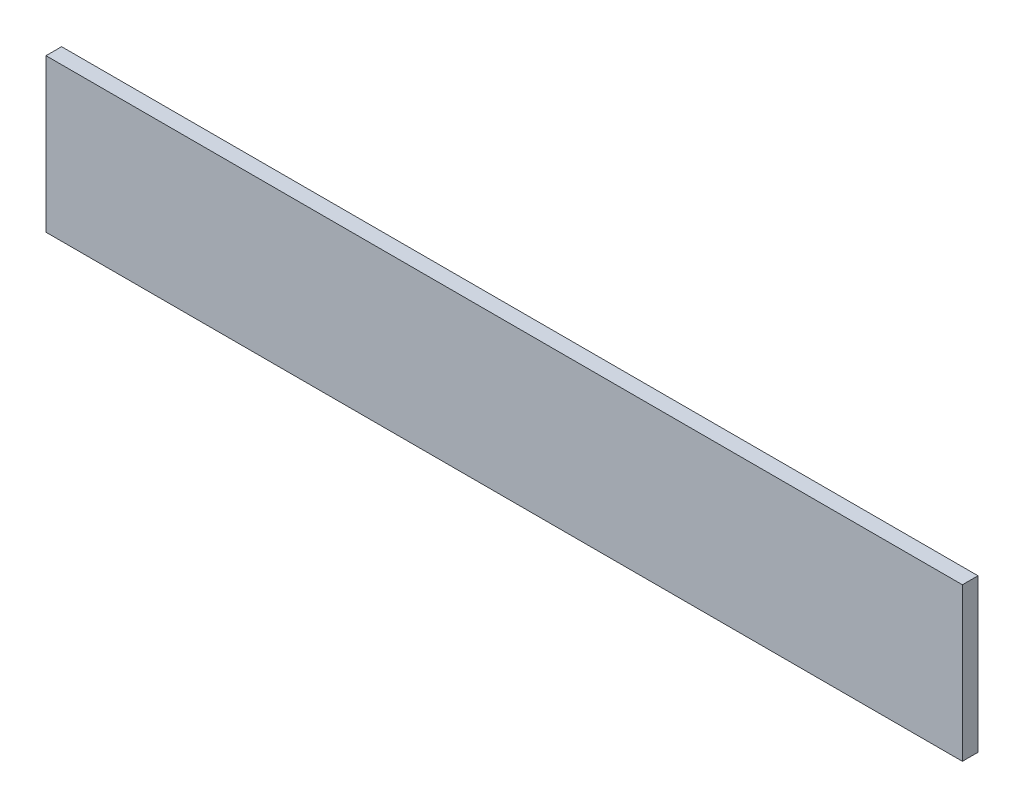
ISO-10303-21;
HEADER;
FILE_DESCRIPTION(('STEP AP214'),'2;1');
FILE_NAME('part.step','',(''),(''),'','','');
FILE_SCHEMA(('AUTOMOTIVE_DESIGN { 1 0 10303 214 1 1 1 1 }'));
ENDSEC;
DATA;
#1=APPLICATION_CONTEXT('core data for automotive mechanical design processes');
#2=APPLICATION_PROTOCOL_DEFINITION('international standard','automotive_design',2000,#1);
#3=PRODUCT_CONTEXT('',#1,'mechanical');
#4=PRODUCT('Part','Part','',(#3));
#5=PRODUCT_RELATED_PRODUCT_CATEGORY('part','',(#4));
#6=PRODUCT_DEFINITION_FORMATION('','',#4);
#7=PRODUCT_DEFINITION_CONTEXT('part definition',#1,'design');
#8=PRODUCT_DEFINITION('design','',#6,#7);
#9=PRODUCT_DEFINITION_SHAPE('','',#8);
#10=(LENGTH_UNIT() NAMED_UNIT(*) SI_UNIT(.MILLI.,.METRE.));
#11=(NAMED_UNIT(*) PLANE_ANGLE_UNIT() SI_UNIT($,.RADIAN.));
#12=(NAMED_UNIT(*) SI_UNIT($,.STERADIAN.) SOLID_ANGLE_UNIT());
#13=UNCERTAINTY_MEASURE_WITH_UNIT(LENGTH_MEASURE(1.E-05),#10,'distance_accuracy_value','');
#14=(GEOMETRIC_REPRESENTATION_CONTEXT(3) GLOBAL_UNCERTAINTY_ASSIGNED_CONTEXT((#13)) GLOBAL_UNIT_ASSIGNED_CONTEXT((#10,
#11,#12)) REPRESENTATION_CONTEXT('',''));
#15=CARTESIAN_POINT('',(0.,0.,0.));
#16=DIRECTION('',(0.,0.,1.));
#17=DIRECTION('',(1.,0.,0.));
#18=AXIS2_PLACEMENT_3D('',#15,#16,#17);
#19=CARTESIAN_POINT('',(88.03,14.69,3.));
#20=DIRECTION('',(-1.,0.,0.));
#21=DIRECTION('',(0.,0.,1.));
#22=AXIS2_PLACEMENT_3D('',#19,#20,#21);
#23=PLANE('',#22);
#24=DIRECTION('',(0.,1.,0.));
#25=VECTOR('',#24,1.);
#26=CARTESIAN_POINT('',(88.03,14.69,0.));
#27=LINE('',#26,#25);
#28=CARTESIAN_POINT('',(88.03,-14.69,0.));
#29=VERTEX_POINT('',#28);
#30=CARTESIAN_POINT('',(88.03,14.69,0.));
#31=VERTEX_POINT('',#30);
#32=EDGE_CURVE('E102',#29,#31,#27,.T.);
#33=ORIENTED_EDGE('',*,*,#32,.T.);
#34=DIRECTION('',(0.,0.,-1.));
#35=VECTOR('',#34,1.);
#36=CARTESIAN_POINT('',(88.03,14.69,3.));
#37=LINE('',#36,#35);
#38=CARTESIAN_POINT('',(88.03,14.69,3.));
#39=VERTEX_POINT('',#38);
#40=EDGE_CURVE('E11',#39,#31,#37,.T.);
#41=ORIENTED_EDGE('',*,*,#40,.F.);
#42=DIRECTION('',(0.,1.,0.));
#43=VECTOR('',#42,1.);
#44=CARTESIAN_POINT('',(88.03,14.69,3.));
#45=LINE('',#44,#43);
#46=CARTESIAN_POINT('',(88.03,-14.69,3.));
#47=VERTEX_POINT('',#46);
#48=EDGE_CURVE('E90',#47,#39,#45,.T.);
#49=ORIENTED_EDGE('',*,*,#48,.F.);
#50=DIRECTION('',(0.,0.,-1.));
#51=VECTOR('',#50,1.);
#52=CARTESIAN_POINT('',(88.03,-14.69,3.));
#53=LINE('',#52,#51);
#54=EDGE_CURVE('E98',#47,#29,#53,.T.);
#55=ORIENTED_EDGE('',*,*,#54,.T.);
#56=EDGE_LOOP('',(#33,#41,#49,#55));
#57=FACE_BOUND('',#56,.T.);
#58=ADVANCED_FACE('F39',(#57),#23,.F.);
#59=CARTESIAN_POINT('',(-88.03,14.69,3.));
#60=DIRECTION('',(0.,-1.,0.));
#61=DIRECTION('',(0.,0.,-1.));
#62=AXIS2_PLACEMENT_3D('',#59,#60,#61);
#63=PLANE('',#62);
#64=DIRECTION('',(-1.,0.,0.));
#65=VECTOR('',#64,1.);
#66=CARTESIAN_POINT('',(-88.03,14.69,0.));
#67=LINE('',#66,#65);
#68=CARTESIAN_POINT('',(-88.03,14.69,0.));
#69=VERTEX_POINT('',#68);
#70=EDGE_CURVE('E94',#31,#69,#67,.T.);
#71=ORIENTED_EDGE('',*,*,#70,.T.);
#72=DIRECTION('',(0.,0.,-1.));
#73=VECTOR('',#72,1.);
#74=CARTESIAN_POINT('',(-88.03,14.69,3.));
#75=LINE('',#74,#73);
#76=CARTESIAN_POINT('',(-88.03,14.69,3.));
#77=VERTEX_POINT('',#76);
#78=EDGE_CURVE('E47',#77,#69,#75,.T.);
#79=ORIENTED_EDGE('',*,*,#78,.F.);
#80=DIRECTION('',(-1.,0.,0.));
#81=VECTOR('',#80,1.);
#82=CARTESIAN_POINT('',(-88.03,14.69,3.));
#83=LINE('',#82,#81);
#84=EDGE_CURVE('E85',#39,#77,#83,.T.);
#85=ORIENTED_EDGE('',*,*,#84,.F.);
#86=ORIENTED_EDGE('',*,*,#40,.T.);
#87=EDGE_LOOP('',(#71,#79,#85,#86));
#88=FACE_BOUND('',#87,.T.);
#89=ADVANCED_FACE('F93',(#88),#63,.F.);
#90=CARTESIAN_POINT('',(-88.03,14.69,3.));
#91=DIRECTION('',(1.,0.,0.));
#92=DIRECTION('',(0.,0.,-1.));
#93=AXIS2_PLACEMENT_3D('',#90,#91,#92);
#94=PLANE('',#93);
#95=DIRECTION('',(0.,-1.,0.));
#96=VECTOR('',#95,1.);
#97=CARTESIAN_POINT('',(-88.03,14.69,0.));
#98=LINE('',#97,#96);
#99=CARTESIAN_POINT('',(-88.03,-14.69,0.));
#100=VERTEX_POINT('',#99);
#101=EDGE_CURVE('E72',#69,#100,#98,.T.);
#102=ORIENTED_EDGE('',*,*,#101,.T.);
#103=DIRECTION('',(0.,0.,-1.));
#104=VECTOR('',#103,1.);
#105=CARTESIAN_POINT('',(-88.03,-14.69,3.));
#106=LINE('',#105,#104);
#107=CARTESIAN_POINT('',(-88.03,-14.69,3.));
#108=VERTEX_POINT('',#107);
#109=EDGE_CURVE('E95',#108,#100,#106,.T.);
#110=ORIENTED_EDGE('',*,*,#109,.F.);
#111=DIRECTION('',(0.,-1.,0.));
#112=VECTOR('',#111,1.);
#113=CARTESIAN_POINT('',(-88.03,14.69,3.));
#114=LINE('',#113,#112);
#115=EDGE_CURVE('E88',#77,#108,#114,.T.);
#116=ORIENTED_EDGE('',*,*,#115,.F.);
#117=ORIENTED_EDGE('',*,*,#78,.T.);
#118=EDGE_LOOP('',(#102,#110,#116,#117));
#119=FACE_BOUND('',#118,.T.);
#120=ADVANCED_FACE('F96',(#119),#94,.F.);
#121=CARTESIAN_POINT('',(-88.03,-14.69,3.));
#122=DIRECTION('',(0.,1.,0.));
#123=DIRECTION('',(0.,0.,1.));
#124=AXIS2_PLACEMENT_3D('',#121,#122,#123);
#125=PLANE('',#124);
#126=DIRECTION('',(1.,0.,0.));
#127=VECTOR('',#126,1.);
#128=CARTESIAN_POINT('',(-88.03,-14.69,0.));
#129=LINE('',#128,#127);
#130=EDGE_CURVE('E78',#100,#29,#129,.T.);
#131=ORIENTED_EDGE('',*,*,#130,.T.);
#132=ORIENTED_EDGE('',*,*,#54,.F.);
#133=DIRECTION('',(1.,0.,0.));
#134=VECTOR('',#133,1.);
#135=CARTESIAN_POINT('',(-88.03,-14.69,3.));
#136=LINE('',#135,#134);
#137=EDGE_CURVE('E55',#108,#47,#136,.T.);
#138=ORIENTED_EDGE('',*,*,#137,.F.);
#139=ORIENTED_EDGE('',*,*,#109,.T.);
#140=EDGE_LOOP('',(#131,#132,#138,#139));
#141=FACE_BOUND('',#140,.T.);
#142=ADVANCED_FACE('F109',(#141),#125,.F.);
#143=CARTESIAN_POINT('',(0.,0.,3.));
#144=DIRECTION('',(0.,0.,1.));
#145=DIRECTION('',(1.,0.,0.));
#146=AXIS2_PLACEMENT_3D('',#143,#144,#145);
#147=PLANE('',#146);
#148=ORIENTED_EDGE('',*,*,#48,.T.);
#149=ORIENTED_EDGE('',*,*,#84,.T.);
#150=ORIENTED_EDGE('',*,*,#115,.T.);
#151=ORIENTED_EDGE('',*,*,#137,.T.);
#152=EDGE_LOOP('',(#148,#149,#150,#151));
#153=FACE_BOUND('',#152,.T.);
#154=ADVANCED_FACE('F86',(#153),#147,.T.);
#155=CARTESIAN_POINT('',(0.,0.,0.));
#156=DIRECTION('',(0.,0.,1.));
#157=DIRECTION('',(1.,0.,0.));
#158=AXIS2_PLACEMENT_3D('',#155,#156,#157);
#159=PLANE('',#158);
#160=ORIENTED_EDGE('',*,*,#32,.F.);
#161=ORIENTED_EDGE('',*,*,#130,.F.);
#162=ORIENTED_EDGE('',*,*,#101,.F.);
#163=ORIENTED_EDGE('',*,*,#70,.F.);
#164=EDGE_LOOP('',(#160,#161,#162,#163));
#165=FACE_BOUND('',#164,.T.);
#166=ADVANCED_FACE('F112',(#165),#159,.F.);
#167=CLOSED_SHELL('',(#58,#89,#120,#142,#154,#166));
#168=MANIFOLD_SOLID_BREP('B2',#167);
#169=ADVANCED_BREP_SHAPE_REPRESENTATION('',(#18,#168),#14);
#170=SHAPE_DEFINITION_REPRESENTATION(#9,#169);
ENDSEC;
END-ISO-10303-21;
